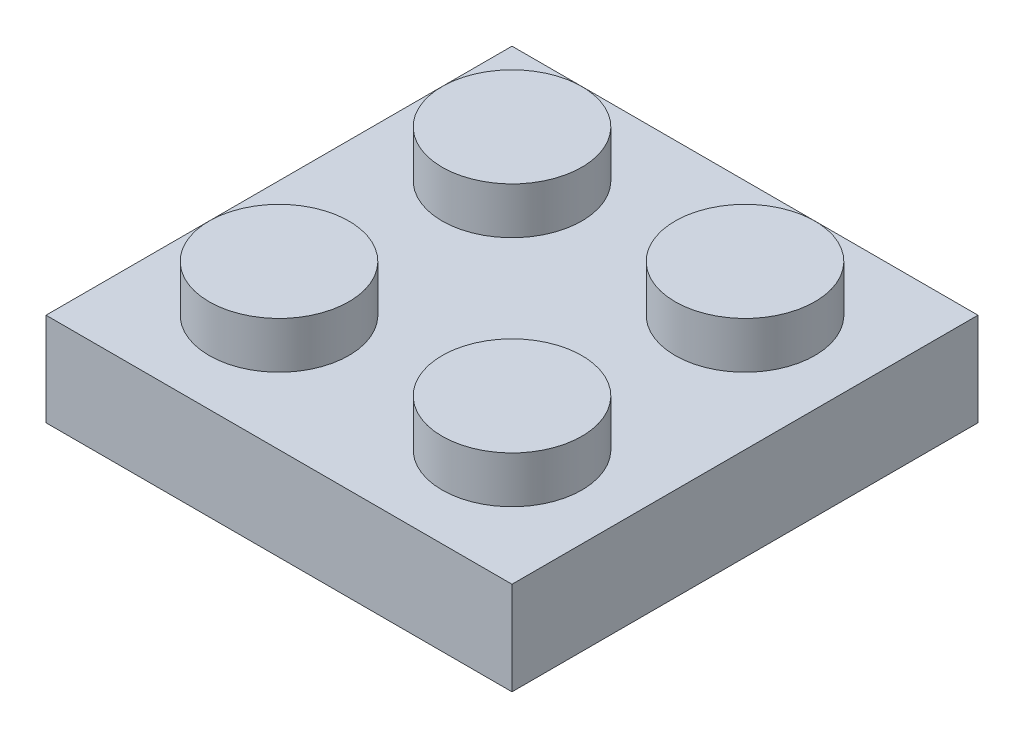
ISO-10303-21;
HEADER;
FILE_DESCRIPTION(('STEP AP214'),'2;1');
FILE_NAME('part.step','',(''),(''),'','','');
FILE_SCHEMA(('AUTOMOTIVE_DESIGN { 1 0 10303 214 1 1 1 1 }'));
ENDSEC;
DATA;
#1=APPLICATION_CONTEXT('core data for automotive mechanical design processes');
#2=APPLICATION_PROTOCOL_DEFINITION('international standard','automotive_design',2000,#1);
#3=PRODUCT_CONTEXT('',#1,'mechanical');
#4=PRODUCT('Part','Part','',(#3));
#5=PRODUCT_RELATED_PRODUCT_CATEGORY('part','',(#4));
#6=PRODUCT_DEFINITION_FORMATION('','',#4);
#7=PRODUCT_DEFINITION_CONTEXT('part definition',#1,'design');
#8=PRODUCT_DEFINITION('design','',#6,#7);
#9=PRODUCT_DEFINITION_SHAPE('','',#8);
#10=(LENGTH_UNIT() NAMED_UNIT(*) SI_UNIT(.MILLI.,.METRE.));
#11=(NAMED_UNIT(*) PLANE_ANGLE_UNIT() SI_UNIT($,.RADIAN.));
#12=(NAMED_UNIT(*) SI_UNIT($,.STERADIAN.) SOLID_ANGLE_UNIT());
#13=UNCERTAINTY_MEASURE_WITH_UNIT(LENGTH_MEASURE(1.E-05),#10,'distance_accuracy_value','');
#14=(GEOMETRIC_REPRESENTATION_CONTEXT(3) GLOBAL_UNCERTAINTY_ASSIGNED_CONTEXT((#13)) GLOBAL_UNIT_ASSIGNED_CONTEXT((#10,
#11,#12)) REPRESENTATION_CONTEXT('',''));
#15=CARTESIAN_POINT('',(0.,0.,0.));
#16=DIRECTION('',(0.,0.,1.));
#17=DIRECTION('',(1.,0.,0.));
#18=AXIS2_PLACEMENT_3D('',#15,#16,#17);
#19=CARTESIAN_POINT('',(0.,0.,0.));
#20=DIRECTION('',(0.,1.,0.));
#21=DIRECTION('',(0.,0.,1.));
#22=AXIS2_PLACEMENT_3D('',#19,#20,#21);
#23=PLANE('',#22);
#24=DIRECTION('',(0.,0.,1.));
#25=VECTOR('',#24,1.);
#26=CARTESIAN_POINT('',(0.999999999999998,0.,0.));
#27=LINE('',#26,#25);
#28=CARTESIAN_POINT('',(1.,0.,-9.));
#29=VERTEX_POINT('',#28);
#30=CARTESIAN_POINT('',(0.999999999999999,0.,-1.));
#31=VERTEX_POINT('',#30);
#32=EDGE_CURVE('E142',#29,#31,#27,.T.);
#33=ORIENTED_EDGE('',*,*,#32,.F.);
#34=DIRECTION('',(1.,0.,0.));
#35=VECTOR('',#34,1.);
#36=CARTESIAN_POINT('',(0.,0.,-9.));
#37=LINE('',#36,#35);
#38=CARTESIAN_POINT('',(9.,0.,-9.));
#39=VERTEX_POINT('',#38);
#40=EDGE_CURVE('E163',#29,#39,#37,.T.);
#41=ORIENTED_EDGE('',*,*,#40,.T.);
#42=DIRECTION('',(0.,0.,1.));
#43=VECTOR('',#42,1.);
#44=CARTESIAN_POINT('',(9.,0.,0.));
#45=LINE('',#44,#43);
#46=CARTESIAN_POINT('',(9.,0.,-0.999999999999997));
#47=VERTEX_POINT('',#46);
#48=EDGE_CURVE('E123',#39,#47,#45,.T.);
#49=ORIENTED_EDGE('',*,*,#48,.T.);
#50=DIRECTION('',(1.,0.,0.));
#51=VECTOR('',#50,1.);
#52=CARTESIAN_POINT('',(0.,0.,-1.));
#53=LINE('',#52,#51);
#54=EDGE_CURVE('E65',#31,#47,#53,.T.);
#55=ORIENTED_EDGE('',*,*,#54,.F.);
#56=EDGE_LOOP('',(#33,#41,#49,#55));
#57=FACE_BOUND('',#56,.T.);
#58=CARTESIAN_POINT('',(5.,0.,-5.));
#59=DIRECTION('',(0.,1.,0.));
#60=DIRECTION('',(0.,0.,1.));
#61=AXIS2_PLACEMENT_3D('',#58,#59,#60);
#62=CIRCLE('',#61,2.03553390593274);
#63=CARTESIAN_POINT('',(5.,0.,-2.96446609406726));
#64=VERTEX_POINT('',#63);
#65=EDGE_CURVE('E169',#64,#64,#62,.T.);
#66=ORIENTED_EDGE('',*,*,#65,.T.);
#67=EDGE_LOOP('',(#66));
#68=FACE_BOUND('',#67,.T.);
#69=ADVANCED_FACE('F50',(#57,#68),#23,.F.);
#70=CARTESIAN_POINT('',(5.,-1.,-5.));
#71=DIRECTION('',(0.,1.,0.));
#72=DIRECTION('',(0.,0.,1.));
#73=AXIS2_PLACEMENT_3D('',#70,#71,#72);
#74=CYLINDRICAL_SURFACE('',#73,2.03553390593274);
#75=CARTESIAN_POINT('',(5.,-1.,-5.));
#76=DIRECTION('',(0.,1.,0.));
#77=DIRECTION('',(0.,0.,1.));
#78=AXIS2_PLACEMENT_3D('',#75,#76,#77);
#79=CIRCLE('',#78,2.03553390593274);
#80=CARTESIAN_POINT('',(5.,-1.,-2.96446609406726));
#81=VERTEX_POINT('',#80);
#82=EDGE_CURVE('E173',#81,#81,#79,.T.);
#83=ORIENTED_EDGE('',*,*,#82,.T.);
#84=EDGE_LOOP('',(#83));
#85=FACE_BOUND('',#84,.T.);
#86=ORIENTED_EDGE('',*,*,#65,.F.);
#87=EDGE_LOOP('',(#86));
#88=FACE_BOUND('',#87,.T.);
#89=ADVANCED_FACE('F225',(#85,#88),#74,.T.);
#90=CARTESIAN_POINT('',(5.,-1.,-5.));
#91=DIRECTION('',(0.,1.,0.));
#92=DIRECTION('',(0.,0.,1.));
#93=AXIS2_PLACEMENT_3D('',#90,#91,#92);
#94=CYLINDRICAL_SURFACE('',#93,1.5);
#95=CARTESIAN_POINT('',(5.,-1.,-5.));
#96=DIRECTION('',(0.,1.,0.));
#97=DIRECTION('',(0.,0.,1.));
#98=AXIS2_PLACEMENT_3D('',#95,#96,#97);
#99=CIRCLE('',#98,1.5);
#100=CARTESIAN_POINT('',(5.,-1.,-3.5));
#101=VERTEX_POINT('',#100);
#102=EDGE_CURVE('E176',#101,#101,#99,.T.);
#103=ORIENTED_EDGE('',*,*,#102,.F.);
#104=EDGE_LOOP('',(#103));
#105=FACE_BOUND('',#104,.T.);
#106=CARTESIAN_POINT('',(5.,0.,-5.));
#107=DIRECTION('',(0.,1.,0.));
#108=DIRECTION('',(0.,0.,1.));
#109=AXIS2_PLACEMENT_3D('',#106,#107,#108);
#110=CIRCLE('',#109,1.5);
#111=CARTESIAN_POINT('',(5.,0.,-3.5));
#112=VERTEX_POINT('',#111);
#113=EDGE_CURVE('E12',#112,#112,#110,.T.);
#114=ORIENTED_EDGE('',*,*,#113,.T.);
#115=EDGE_LOOP('',(#114));
#116=FACE_BOUND('',#115,.T.);
#117=ADVANCED_FACE('F231',(#105,#116),#94,.F.);
#118=CARTESIAN_POINT('',(0.,-1.,0.));
#119=DIRECTION('',(0.,1.,0.));
#120=DIRECTION('',(0.,0.,1.));
#121=AXIS2_PLACEMENT_3D('',#118,#119,#120);
#122=PLANE('',#121);
#123=ORIENTED_EDGE('',*,*,#82,.F.);
#124=EDGE_LOOP('',(#123));
#125=FACE_BOUND('',#124,.T.);
#126=ORIENTED_EDGE('',*,*,#102,.T.);
#127=EDGE_LOOP('',(#126));
#128=FACE_BOUND('',#127,.T.);
#129=ADVANCED_FACE('F237',(#125,#128),#122,.F.);
#130=ORIENTED_EDGE('',*,*,#113,.F.);
#131=EDGE_LOOP('',(#130));
#132=FACE_BOUND('',#131,.T.);
#133=ADVANCED_FACE('F227',(#132),#23,.F.);
#134=CARTESIAN_POINT('',(0.,-1.,-9.));
#135=DIRECTION('',(0.,0.,1.));
#136=DIRECTION('',(1.,0.,0.));
#137=AXIS2_PLACEMENT_3D('',#134,#135,#136);
#138=PLANE('',#137);
#139=ORIENTED_EDGE('',*,*,#40,.F.);
#140=DIRECTION('',(0.,1.,0.));
#141=VECTOR('',#140,1.);
#142=CARTESIAN_POINT('',(1.,-1.,-9.));
#143=LINE('',#142,#141);
#144=CARTESIAN_POINT('',(1.,-1.,-9.));
#145=VERTEX_POINT('',#144);
#146=EDGE_CURVE('E140',#145,#29,#143,.T.);
#147=ORIENTED_EDGE('',*,*,#146,.F.);
#148=DIRECTION('',(1.,0.,0.));
#149=VECTOR('',#148,1.);
#150=CARTESIAN_POINT('',(0.,-1.,-9.));
#151=LINE('',#150,#149);
#152=CARTESIAN_POINT('',(9.,-1.,-9.));
#153=VERTEX_POINT('',#152);
#154=EDGE_CURVE('E135',#145,#153,#151,.T.);
#155=ORIENTED_EDGE('',*,*,#154,.T.);
#156=DIRECTION('',(0.,1.,0.));
#157=VECTOR('',#156,1.);
#158=CARTESIAN_POINT('',(9.,-1.,-9.));
#159=LINE('',#158,#157);
#160=EDGE_CURVE('E118',#153,#39,#159,.T.);
#161=ORIENTED_EDGE('',*,*,#160,.T.);
#162=EDGE_LOOP('',(#139,#147,#155,#161));
#163=FACE_BOUND('',#162,.T.);
#164=ADVANCED_FACE('F139',(#163),#138,.T.);
#165=CARTESIAN_POINT('',(0.999999999999998,-1.,0.));
#166=DIRECTION('',(-1.,0.,0.));
#167=DIRECTION('',(0.,0.,1.));
#168=AXIS2_PLACEMENT_3D('',#165,#166,#167);
#169=PLANE('',#168);
#170=ORIENTED_EDGE('',*,*,#32,.T.);
#171=DIRECTION('',(0.,1.,0.));
#172=VECTOR('',#171,1.);
#173=CARTESIAN_POINT('',(0.999999999999999,-1.,-1.));
#174=LINE('',#173,#172);
#175=CARTESIAN_POINT('',(0.999999999999999,-1.,-1.));
#176=VERTEX_POINT('',#175);
#177=EDGE_CURVE('E170',#176,#31,#174,.T.);
#178=ORIENTED_EDGE('',*,*,#177,.F.);
#179=DIRECTION('',(0.,0.,1.));
#180=VECTOR('',#179,1.);
#181=CARTESIAN_POINT('',(0.999999999999998,-1.,0.));
#182=LINE('',#181,#180);
#183=EDGE_CURVE('E150',#145,#176,#182,.T.);
#184=ORIENTED_EDGE('',*,*,#183,.F.);
#185=ORIENTED_EDGE('',*,*,#146,.T.);
#186=EDGE_LOOP('',(#170,#178,#184,#185));
#187=FACE_BOUND('',#186,.T.);
#188=ADVANCED_FACE('F243',(#187),#169,.F.);
#189=CARTESIAN_POINT('',(0.,-1.,-1.));
#190=DIRECTION('',(0.,0.,1.));
#191=DIRECTION('',(1.,0.,0.));
#192=AXIS2_PLACEMENT_3D('',#189,#190,#191);
#193=PLANE('',#192);
#194=ORIENTED_EDGE('',*,*,#54,.T.);
#195=DIRECTION('',(0.,1.,0.));
#196=VECTOR('',#195,1.);
#197=CARTESIAN_POINT('',(9.,-1.,-0.999999999999997));
#198=LINE('',#197,#196);
#199=CARTESIAN_POINT('',(9.,-1.,-0.999999999999997));
#200=VERTEX_POINT('',#199);
#201=EDGE_CURVE('E128',#200,#47,#198,.T.);
#202=ORIENTED_EDGE('',*,*,#201,.F.);
#203=DIRECTION('',(1.,0.,0.));
#204=VECTOR('',#203,1.);
#205=CARTESIAN_POINT('',(0.,-1.,-1.));
#206=LINE('',#205,#204);
#207=EDGE_CURVE('E137',#176,#200,#206,.T.);
#208=ORIENTED_EDGE('',*,*,#207,.F.);
#209=ORIENTED_EDGE('',*,*,#177,.T.);
#210=EDGE_LOOP('',(#194,#202,#208,#209));
#211=FACE_BOUND('',#210,.T.);
#212=ADVANCED_FACE('F258',(#211),#193,.F.);
#213=CARTESIAN_POINT('',(9.,-1.,0.));
#214=DIRECTION('',(-1.,0.,0.));
#215=DIRECTION('',(0.,0.,1.));
#216=AXIS2_PLACEMENT_3D('',#213,#214,#215);
#217=PLANE('',#216);
#218=ORIENTED_EDGE('',*,*,#48,.F.);
#219=ORIENTED_EDGE('',*,*,#160,.F.);
#220=DIRECTION('',(0.,0.,1.));
#221=VECTOR('',#220,1.);
#222=CARTESIAN_POINT('',(9.,-1.,0.));
#223=LINE('',#222,#221);
#224=EDGE_CURVE('E121',#153,#200,#223,.T.);
#225=ORIENTED_EDGE('',*,*,#224,.T.);
#226=ORIENTED_EDGE('',*,*,#201,.T.);
#227=EDGE_LOOP('',(#218,#219,#225,#226));
#228=FACE_BOUND('',#227,.T.);
#229=ADVANCED_FACE('F120',(#228),#217,.T.);
#230=CARTESIAN_POINT('',(0.,-1.,0.));
#231=DIRECTION('',(0.,1.,0.));
#232=DIRECTION('',(0.,0.,1.));
#233=AXIS2_PLACEMENT_3D('',#230,#231,#232);
#234=PLANE('',#233);
#235=ORIENTED_EDGE('',*,*,#154,.F.);
#236=ORIENTED_EDGE('',*,*,#183,.T.);
#237=ORIENTED_EDGE('',*,*,#207,.T.);
#238=ORIENTED_EDGE('',*,*,#224,.F.);
#239=EDGE_LOOP('',(#235,#236,#237,#238));
#240=FACE_BOUND('',#239,.T.);
#241=DIRECTION('',(0.,0.,-1.));
#242=VECTOR('',#241,1.);
#243=CARTESIAN_POINT('',(10.,-1.,0.));
#244=LINE('',#243,#242);
#245=CARTESIAN_POINT('',(10.,-1.,0.));
#246=VERTEX_POINT('',#245);
#247=CARTESIAN_POINT('',(10.,-1.,-10.));
#248=VERTEX_POINT('',#247);
#249=EDGE_CURVE('E152',#246,#248,#244,.T.);
#250=ORIENTED_EDGE('',*,*,#249,.F.);
#251=DIRECTION('',(1.,0.,0.));
#252=VECTOR('',#251,1.);
#253=CARTESIAN_POINT('',(0.,-1.,0.));
#254=LINE('',#253,#252);
#255=CARTESIAN_POINT('',(0.,-1.,0.));
#256=VERTEX_POINT('',#255);
#257=EDGE_CURVE('E129',#256,#246,#254,.T.);
#258=ORIENTED_EDGE('',*,*,#257,.F.);
#259=DIRECTION('',(0.,0.,-1.));
#260=VECTOR('',#259,1.);
#261=CARTESIAN_POINT('',(0.,-1.,0.));
#262=LINE('',#261,#260);
#263=CARTESIAN_POINT('',(0.,-1.,-10.));
#264=VERTEX_POINT('',#263);
#265=EDGE_CURVE('E158',#256,#264,#262,.T.);
#266=ORIENTED_EDGE('',*,*,#265,.T.);
#267=DIRECTION('',(1.,0.,0.));
#268=VECTOR('',#267,1.);
#269=CARTESIAN_POINT('',(0.,-1.,-10.));
#270=LINE('',#269,#268);
#271=EDGE_CURVE('E155',#264,#248,#270,.T.);
#272=ORIENTED_EDGE('',*,*,#271,.T.);
#273=EDGE_LOOP('',(#250,#258,#266,#272));
#274=FACE_BOUND('',#273,.T.);
#275=ADVANCED_FACE('F133',(#240,#274),#234,.F.);
#276=CARTESIAN_POINT('',(0.,1.,0.));
#277=DIRECTION('',(0.,1.,0.));
#278=DIRECTION('',(0.,0.,1.));
#279=AXIS2_PLACEMENT_3D('',#276,#277,#278);
#280=PLANE('',#279);
#281=CARTESIAN_POINT('',(7.49999999999998,1.,-7.5));
#282=DIRECTION('',(0.,1.,0.));
#283=DIRECTION('',(0.,0.,1.));
#284=AXIS2_PLACEMENT_3D('',#281,#282,#283);
#285=CIRCLE('',#284,1.5);
#286=CARTESIAN_POINT('',(7.49999999999998,1.,-6.));
#287=VERTEX_POINT('',#286);
#288=EDGE_CURVE('E301',#287,#287,#285,.T.);
#289=ORIENTED_EDGE('',*,*,#288,.F.);
#290=EDGE_LOOP('',(#289));
#291=FACE_BOUND('',#290,.T.);
#292=CARTESIAN_POINT('',(2.49999999999998,1.,-7.49999999999997));
#293=DIRECTION('',(0.,1.,0.));
#294=DIRECTION('',(0.,0.,1.));
#295=AXIS2_PLACEMENT_3D('',#292,#293,#294);
#296=CIRCLE('',#295,1.5);
#297=CARTESIAN_POINT('',(2.49999999999998,1.,-5.99999999999996));
#298=VERTEX_POINT('',#297);
#299=EDGE_CURVE('E300',#298,#298,#296,.T.);
#300=ORIENTED_EDGE('',*,*,#299,.F.);
#301=EDGE_LOOP('',(#300));
#302=FACE_BOUND('',#301,.T.);
#303=CARTESIAN_POINT('',(2.5,1.,-2.49999999999996));
#304=DIRECTION('',(0.,1.,0.));
#305=DIRECTION('',(0.,0.,1.));
#306=AXIS2_PLACEMENT_3D('',#303,#304,#305);
#307=CIRCLE('',#306,1.5);
#308=CARTESIAN_POINT('',(2.5,1.,-0.999999999999964));
#309=VERTEX_POINT('',#308);
#310=EDGE_CURVE('E310',#309,#309,#307,.T.);
#311=ORIENTED_EDGE('',*,*,#310,.F.);
#312=EDGE_LOOP('',(#311));
#313=FACE_BOUND('',#312,.T.);
#314=CARTESIAN_POINT('',(7.5,1.,-2.5));
#315=DIRECTION('',(0.,1.,0.));
#316=DIRECTION('',(0.,0.,1.));
#317=AXIS2_PLACEMENT_3D('',#314,#315,#316);
#318=CIRCLE('',#317,1.5);
#319=CARTESIAN_POINT('',(7.5,1.,-0.999999999999999));
#320=VERTEX_POINT('',#319);
#321=EDGE_CURVE('E146',#320,#320,#318,.T.);
#322=ORIENTED_EDGE('',*,*,#321,.F.);
#323=EDGE_LOOP('',(#322));
#324=FACE_BOUND('',#323,.T.);
#325=DIRECTION('',(0.,0.,-1.));
#326=VECTOR('',#325,1.);
#327=CARTESIAN_POINT('',(10.,1.,0.));
#328=LINE('',#327,#326);
#329=CARTESIAN_POINT('',(10.,1.,0.));
#330=VERTEX_POINT('',#329);
#331=CARTESIAN_POINT('',(10.,1.,-10.));
#332=VERTEX_POINT('',#331);
#333=EDGE_CURVE('E179',#330,#332,#328,.T.);
#334=ORIENTED_EDGE('',*,*,#333,.T.);
#335=DIRECTION('',(1.,0.,0.));
#336=VECTOR('',#335,1.);
#337=CARTESIAN_POINT('',(0.,1.,-10.));
#338=LINE('',#337,#336);
#339=CARTESIAN_POINT('',(0.,1.,-10.));
#340=VERTEX_POINT('',#339);
#341=EDGE_CURVE('E183',#340,#332,#338,.T.);
#342=ORIENTED_EDGE('',*,*,#341,.F.);
#343=DIRECTION('',(0.,0.,-1.));
#344=VECTOR('',#343,1.);
#345=CARTESIAN_POINT('',(0.,1.,0.));
#346=LINE('',#345,#344);
#347=CARTESIAN_POINT('',(0.,1.,0.));
#348=VERTEX_POINT('',#347);
#349=EDGE_CURVE('E186',#348,#340,#346,.T.);
#350=ORIENTED_EDGE('',*,*,#349,.F.);
#351=DIRECTION('',(1.,0.,0.));
#352=VECTOR('',#351,1.);
#353=CARTESIAN_POINT('',(0.,1.,0.));
#354=LINE('',#353,#352);
#355=EDGE_CURVE('E73',#348,#330,#354,.T.);
#356=ORIENTED_EDGE('',*,*,#355,.T.);
#357=EDGE_LOOP('',(#334,#342,#350,#356));
#358=FACE_BOUND('',#357,.T.);
#359=ADVANCED_FACE('F209',(#291,#302,#313,#324,#358),#280,.T.);
#360=CARTESIAN_POINT('',(0.,1.,-10.));
#361=DIRECTION('',(0.,0.,-1.));
#362=DIRECTION('',(-1.,0.,0.));
#363=AXIS2_PLACEMENT_3D('',#360,#361,#362);
#364=PLANE('',#363);
#365=DIRECTION('',(0.,-1.,0.));
#366=VECTOR('',#365,1.);
#367=CARTESIAN_POINT('',(10.,1.,-10.));
#368=LINE('',#367,#366);
#369=EDGE_CURVE('E58',#332,#248,#368,.T.);
#370=ORIENTED_EDGE('',*,*,#369,.T.);
#371=ORIENTED_EDGE('',*,*,#271,.F.);
#372=DIRECTION('',(0.,-1.,0.));
#373=VECTOR('',#372,1.);
#374=CARTESIAN_POINT('',(0.,1.,-10.));
#375=LINE('',#374,#373);
#376=EDGE_CURVE('E194',#340,#264,#375,.T.);
#377=ORIENTED_EDGE('',*,*,#376,.F.);
#378=ORIENTED_EDGE('',*,*,#341,.T.);
#379=EDGE_LOOP('',(#370,#371,#377,#378));
#380=FACE_BOUND('',#379,.T.);
#381=ADVANCED_FACE('F198',(#380),#364,.T.);
#382=CARTESIAN_POINT('',(0.,1.,0.));
#383=DIRECTION('',(-1.,0.,0.));
#384=DIRECTION('',(0.,0.,1.));
#385=AXIS2_PLACEMENT_3D('',#382,#383,#384);
#386=PLANE('',#385);
#387=ORIENTED_EDGE('',*,*,#376,.T.);
#388=ORIENTED_EDGE('',*,*,#265,.F.);
#389=DIRECTION('',(0.,-1.,0.));
#390=VECTOR('',#389,1.);
#391=CARTESIAN_POINT('',(0.,1.,0.));
#392=LINE('',#391,#390);
#393=EDGE_CURVE('E192',#348,#256,#392,.T.);
#394=ORIENTED_EDGE('',*,*,#393,.F.);
#395=ORIENTED_EDGE('',*,*,#349,.T.);
#396=EDGE_LOOP('',(#387,#388,#394,#395));
#397=FACE_BOUND('',#396,.T.);
#398=ADVANCED_FACE('F208',(#397),#386,.T.);
#399=CARTESIAN_POINT('',(0.,1.,0.));
#400=DIRECTION('',(0.,0.,-1.));
#401=DIRECTION('',(-1.,0.,0.));
#402=AXIS2_PLACEMENT_3D('',#399,#400,#401);
#403=PLANE('',#402);
#404=ORIENTED_EDGE('',*,*,#393,.T.);
#405=ORIENTED_EDGE('',*,*,#257,.T.);
#406=DIRECTION('',(0.,-1.,0.));
#407=VECTOR('',#406,1.);
#408=CARTESIAN_POINT('',(10.,1.,0.));
#409=LINE('',#408,#407);
#410=EDGE_CURVE('E190',#330,#246,#409,.T.);
#411=ORIENTED_EDGE('',*,*,#410,.F.);
#412=ORIENTED_EDGE('',*,*,#355,.F.);
#413=EDGE_LOOP('',(#404,#405,#411,#412));
#414=FACE_BOUND('',#413,.T.);
#415=ADVANCED_FACE('F206',(#414),#403,.F.);
#416=CARTESIAN_POINT('',(10.,1.,0.));
#417=DIRECTION('',(-1.,0.,0.));
#418=DIRECTION('',(0.,0.,1.));
#419=AXIS2_PLACEMENT_3D('',#416,#417,#418);
#420=PLANE('',#419);
#421=ORIENTED_EDGE('',*,*,#410,.T.);
#422=ORIENTED_EDGE('',*,*,#249,.T.);
#423=ORIENTED_EDGE('',*,*,#369,.F.);
#424=ORIENTED_EDGE('',*,*,#333,.F.);
#425=EDGE_LOOP('',(#421,#422,#423,#424));
#426=FACE_BOUND('',#425,.T.);
#427=ADVANCED_FACE('F52',(#426),#420,.F.);
#428=CARTESIAN_POINT('',(7.5,2.,-2.5));
#429=DIRECTION('',(0.,-1.,0.));
#430=DIRECTION('',(0.,0.,-1.));
#431=AXIS2_PLACEMENT_3D('',#428,#429,#430);
#432=CYLINDRICAL_SURFACE('',#431,1.5);
#433=CARTESIAN_POINT('',(7.5,2.,-2.5));
#434=DIRECTION('',(0.,1.,0.));
#435=DIRECTION('',(0.,0.,1.));
#436=AXIS2_PLACEMENT_3D('',#433,#434,#435);
#437=CIRCLE('',#436,1.5);
#438=CARTESIAN_POINT('',(7.5,2.,-0.999999999999999));
#439=VERTEX_POINT('',#438);
#440=EDGE_CURVE('E165',#439,#439,#437,.T.);
#441=ORIENTED_EDGE('',*,*,#440,.F.);
#442=EDGE_LOOP('',(#441));
#443=FACE_BOUND('',#442,.T.);
#444=ORIENTED_EDGE('',*,*,#321,.T.);
#445=EDGE_LOOP('',(#444));
#446=FACE_BOUND('',#445,.T.);
#447=ADVANCED_FACE('F264',(#443,#446),#432,.T.);
#448=CARTESIAN_POINT('',(7.5,2.,-2.5));
#449=DIRECTION('',(0.,1.,0.));
#450=DIRECTION('',(0.,0.,1.));
#451=AXIS2_PLACEMENT_3D('',#448,#449,#450);
#452=PLANE('',#451);
#453=ORIENTED_EDGE('',*,*,#440,.T.);
#454=EDGE_LOOP('',(#453));
#455=FACE_BOUND('',#454,.T.);
#456=ADVANCED_FACE('F267',(#455),#452,.T.);
#457=CARTESIAN_POINT('',(2.5,2.,-2.49999999999996));
#458=DIRECTION('',(0.,-1.,0.));
#459=DIRECTION('',(0.,0.,-1.));
#460=AXIS2_PLACEMENT_3D('',#457,#458,#459);
#461=CYLINDRICAL_SURFACE('',#460,1.5);
#462=CARTESIAN_POINT('',(2.5,2.,-2.49999999999996));
#463=DIRECTION('',(0.,1.,0.));
#464=DIRECTION('',(0.,0.,1.));
#465=AXIS2_PLACEMENT_3D('',#462,#463,#464);
#466=CIRCLE('',#465,1.5);
#467=CARTESIAN_POINT('',(2.5,2.,-0.999999999999964));
#468=VERTEX_POINT('',#467);
#469=EDGE_CURVE('E312',#468,#468,#466,.T.);
#470=ORIENTED_EDGE('',*,*,#469,.F.);
#471=EDGE_LOOP('',(#470));
#472=FACE_BOUND('',#471,.T.);
#473=ORIENTED_EDGE('',*,*,#310,.T.);
#474=EDGE_LOOP('',(#473));
#475=FACE_BOUND('',#474,.T.);
#476=ADVANCED_FACE('F271',(#472,#475),#461,.T.);
#477=CARTESIAN_POINT('',(2.5,2.,-2.49999999999996));
#478=DIRECTION('',(0.,1.,0.));
#479=DIRECTION('',(0.,0.,1.));
#480=AXIS2_PLACEMENT_3D('',#477,#478,#479);
#481=PLANE('',#480);
#482=ORIENTED_EDGE('',*,*,#469,.T.);
#483=EDGE_LOOP('',(#482));
#484=FACE_BOUND('',#483,.T.);
#485=ADVANCED_FACE('F275',(#484),#481,.T.);
#486=CARTESIAN_POINT('',(2.49999999999998,2.,-7.49999999999997));
#487=DIRECTION('',(0.,-1.,0.));
#488=DIRECTION('',(0.,0.,-1.));
#489=AXIS2_PLACEMENT_3D('',#486,#487,#488);
#490=CYLINDRICAL_SURFACE('',#489,1.5);
#491=CARTESIAN_POINT('',(2.49999999999998,2.,-7.49999999999997));
#492=DIRECTION('',(0.,1.,0.));
#493=DIRECTION('',(0.,0.,1.));
#494=AXIS2_PLACEMENT_3D('',#491,#492,#493);
#495=CIRCLE('',#494,1.5);
#496=CARTESIAN_POINT('',(2.49999999999998,2.,-5.99999999999996));
#497=VERTEX_POINT('',#496);
#498=EDGE_CURVE('E304',#497,#497,#495,.T.);
#499=ORIENTED_EDGE('',*,*,#498,.F.);
#500=EDGE_LOOP('',(#499));
#501=FACE_BOUND('',#500,.T.);
#502=ORIENTED_EDGE('',*,*,#299,.T.);
#503=EDGE_LOOP('',(#502));
#504=FACE_BOUND('',#503,.T.);
#505=ADVANCED_FACE('F279',(#501,#504),#490,.T.);
#506=CARTESIAN_POINT('',(2.49999999999998,2.,-7.49999999999997));
#507=DIRECTION('',(0.,1.,0.));
#508=DIRECTION('',(0.,0.,1.));
#509=AXIS2_PLACEMENT_3D('',#506,#507,#508);
#510=PLANE('',#509);
#511=ORIENTED_EDGE('',*,*,#498,.T.);
#512=EDGE_LOOP('',(#511));
#513=FACE_BOUND('',#512,.T.);
#514=ADVANCED_FACE('F283',(#513),#510,.T.);
#515=CARTESIAN_POINT('',(7.49999999999998,2.,-7.5));
#516=DIRECTION('',(0.,-1.,0.));
#517=DIRECTION('',(0.,0.,-1.));
#518=AXIS2_PLACEMENT_3D('',#515,#516,#517);
#519=CYLINDRICAL_SURFACE('',#518,1.5);
#520=CARTESIAN_POINT('',(7.49999999999998,2.,-7.5));
#521=DIRECTION('',(0.,1.,0.));
#522=DIRECTION('',(0.,0.,1.));
#523=AXIS2_PLACEMENT_3D('',#520,#521,#522);
#524=CIRCLE('',#523,1.5);
#525=CARTESIAN_POINT('',(7.49999999999998,2.,-6.));
#526=VERTEX_POINT('',#525);
#527=EDGE_CURVE('E299',#526,#526,#524,.T.);
#528=ORIENTED_EDGE('',*,*,#527,.F.);
#529=EDGE_LOOP('',(#528));
#530=FACE_BOUND('',#529,.T.);
#531=ORIENTED_EDGE('',*,*,#288,.T.);
#532=EDGE_LOOP('',(#531));
#533=FACE_BOUND('',#532,.T.);
#534=ADVANCED_FACE('F287',(#530,#533),#519,.T.);
#535=CARTESIAN_POINT('',(7.49999999999998,2.,-7.5));
#536=DIRECTION('',(0.,1.,0.));
#537=DIRECTION('',(0.,0.,1.));
#538=AXIS2_PLACEMENT_3D('',#535,#536,#537);
#539=PLANE('',#538);
#540=ORIENTED_EDGE('',*,*,#527,.T.);
#541=EDGE_LOOP('',(#540));
#542=FACE_BOUND('',#541,.T.);
#543=ADVANCED_FACE('F291',(#542),#539,.T.);
#544=CLOSED_SHELL('',(#69,#89,#117,#129,#133,#164,#188,#212,#229,#275,#359,#381,#398,#415,#427,
#447,#456,#476,#485,#505,#514,#534,#543));
#545=MANIFOLD_SOLID_BREP('B2',#544);
#546=ADVANCED_BREP_SHAPE_REPRESENTATION('',(#18,#545),#14);
#547=SHAPE_DEFINITION_REPRESENTATION(#9,#546);
ENDSEC;
END-ISO-10303-21;
